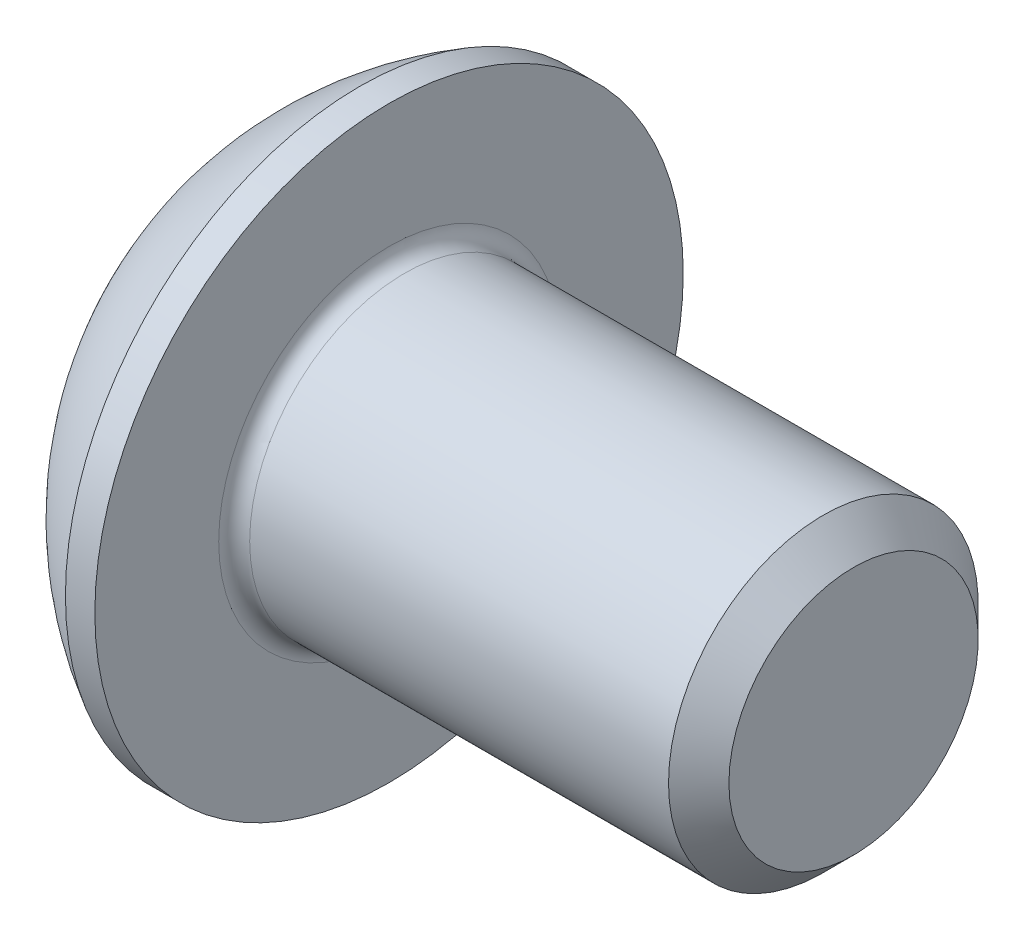
ISO-10303-21;
HEADER;
FILE_DESCRIPTION(('STEP AP214'),'2;1');
FILE_NAME('part.step','',(''),(''),'','','');
FILE_SCHEMA(('AUTOMOTIVE_DESIGN { 1 0 10303 214 1 1 1 1 }'));
ENDSEC;
DATA;
#1=APPLICATION_CONTEXT('core data for automotive mechanical design processes');
#2=APPLICATION_PROTOCOL_DEFINITION('international standard','automotive_design',2000,#1);
#3=PRODUCT_CONTEXT('',#1,'mechanical');
#4=PRODUCT('Part','Part','',(#3));
#5=PRODUCT_RELATED_PRODUCT_CATEGORY('part','',(#4));
#6=PRODUCT_DEFINITION_FORMATION('','',#4);
#7=PRODUCT_DEFINITION_CONTEXT('part definition',#1,'design');
#8=PRODUCT_DEFINITION('design','',#6,#7);
#9=PRODUCT_DEFINITION_SHAPE('','',#8);
#10=(LENGTH_UNIT() NAMED_UNIT(*) SI_UNIT(.MILLI.,.METRE.));
#11=(NAMED_UNIT(*) PLANE_ANGLE_UNIT() SI_UNIT($,.RADIAN.));
#12=(NAMED_UNIT(*) SI_UNIT($,.STERADIAN.) SOLID_ANGLE_UNIT());
#13=UNCERTAINTY_MEASURE_WITH_UNIT(LENGTH_MEASURE(1.E-05),#10,'distance_accuracy_value','');
#14=(GEOMETRIC_REPRESENTATION_CONTEXT(3) GLOBAL_UNCERTAINTY_ASSIGNED_CONTEXT((#13)) GLOBAL_UNIT_ASSIGNED_CONTEXT((#10,
#11,#12)) REPRESENTATION_CONTEXT('',''));
#15=CARTESIAN_POINT('',(0.,0.,0.));
#16=DIRECTION('',(0.,0.,1.));
#17=DIRECTION('',(1.,0.,0.));
#18=AXIS2_PLACEMENT_3D('',#15,#16,#17);
#19=CARTESIAN_POINT('',(0.,0.,0.));
#20=DIRECTION('',(-1.,0.,0.));
#21=DIRECTION('',(0.,0.,1.));
#22=AXIS2_PLACEMENT_3D('',#19,#20,#21);
#23=PLANE('',#22);
#24=CARTESIAN_POINT('',(0.,0.,0.));
#25=DIRECTION('',(-1.,0.,0.));
#26=DIRECTION('',(0.,0.,1.));
#27=AXIS2_PLACEMENT_3D('',#24,#25,#26);
#28=CIRCLE('',#27,1.9);
#29=CARTESIAN_POINT('',(0.,0.,1.9));
#30=VERTEX_POINT('',#29);
#31=EDGE_CURVE('E160',#30,#30,#28,.T.);
#32=ORIENTED_EDGE('',*,*,#31,.T.);
#33=EDGE_LOOP('',(#32));
#34=FACE_BOUND('',#33,.T.);
#35=DIRECTION('',(0.,-1.,0.));
#36=VECTOR('',#35,1.);
#37=CARTESIAN_POINT('',(0.,-0.721687836487045,1.24999999999986));
#38=LINE('',#37,#36);
#39=CARTESIAN_POINT('',(0.,0.721687836487378,1.25000000000008));
#40=VERTEX_POINT('',#39);
#41=CARTESIAN_POINT('',(0.,-0.721687836487045,1.24999999999986));
#42=VERTEX_POINT('',#41);
#43=EDGE_CURVE('E55',#40,#42,#38,.T.);
#44=ORIENTED_EDGE('',*,*,#43,.T.);
#45=DIRECTION('',(0.,-0.500000000000001,-0.86602540378444));
#46=VECTOR('',#45,1.);
#47=CARTESIAN_POINT('',(0.,-1.44337567297406,-1.66533453693773E-13));
#48=LINE('',#47,#46);
#49=CARTESIAN_POINT('',(0.,-1.44337567297406,-1.66533453693773E-13));
#50=VERTEX_POINT('',#49);
#51=EDGE_CURVE('E280',#42,#50,#48,.T.);
#52=ORIENTED_EDGE('',*,*,#51,.T.);
#53=DIRECTION('',(0.,0.5,-0.866025403784439));
#54=VECTOR('',#53,1.);
#55=CARTESIAN_POINT('',(0.,-0.7216878364871,-1.24999999999997));
#56=LINE('',#55,#54);
#57=CARTESIAN_POINT('',(0.,-0.7216878364871,-1.24999999999997));
#58=VERTEX_POINT('',#57);
#59=EDGE_CURVE('E135',#50,#58,#56,.T.);
#60=ORIENTED_EDGE('',*,*,#59,.T.);
#61=DIRECTION('',(0.,1.,0.));
#62=VECTOR('',#61,1.);
#63=CARTESIAN_POINT('',(0.,0.721687836486962,-1.24999999999997));
#64=LINE('',#63,#62);
#65=CARTESIAN_POINT('',(0.,0.721687836486962,-1.24999999999997));
#66=VERTEX_POINT('',#65);
#67=EDGE_CURVE('E283',#58,#66,#64,.T.);
#68=ORIENTED_EDGE('',*,*,#67,.T.);
#69=DIRECTION('',(0.,0.5,0.86602540378444));
#70=VECTOR('',#69,1.);
#71=CARTESIAN_POINT('',(0.,1.44337567297384,0.));
#72=LINE('',#71,#70);
#73=CARTESIAN_POINT('',(0.,1.44337567297384,0.));
#74=VERTEX_POINT('',#73);
#75=EDGE_CURVE('E285',#66,#74,#72,.T.);
#76=ORIENTED_EDGE('',*,*,#75,.T.);
#77=DIRECTION('',(0.,-0.500000000000001,0.86602540378444));
#78=VECTOR('',#77,1.);
#79=CARTESIAN_POINT('',(0.,0.721687836487378,1.25000000000008));
#80=LINE('',#79,#78);
#81=EDGE_CURVE('E287',#74,#40,#80,.T.);
#82=ORIENTED_EDGE('',*,*,#81,.T.);
#83=EDGE_LOOP('',(#44,#52,#60,#68,#76,#82));
#84=FACE_BOUND('',#83,.T.);
#85=ADVANCED_FACE('F40',(#34,#84),#23,.T.);
#86=CARTESIAN_POINT('',(3.88527472527479,-1.38777878078145E-13,-2.22044604925031E-13));
#87=DIRECTION('',(-1.,0.,0.));
#88=DIRECTION('',(0.,1.,0.));
#89=AXIS2_PLACEMENT_3D('',#86,#87,#88);
#90=SPHERICAL_SURFACE('',#89,4.3249693283142);
#91=CARTESIAN_POINT('',(1.82000000000005,0.,0.));
#92=DIRECTION('',(-1.,0.,0.));
#93=DIRECTION('',(0.,0.,1.));
#94=AXIS2_PLACEMENT_3D('',#91,#92,#93);
#95=CIRCLE('',#94,3.8);
#96=CARTESIAN_POINT('',(1.82000000000005,0.,3.80000000000006));
#97=VERTEX_POINT('',#96);
#98=EDGE_CURVE('E157',#97,#97,#95,.T.);
#99=ORIENTED_EDGE('',*,*,#98,.T.);
#100=EDGE_LOOP('',(#99));
#101=FACE_BOUND('',#100,.T.);
#102=ORIENTED_EDGE('',*,*,#31,.F.);
#103=EDGE_LOOP('',(#102));
#104=FACE_BOUND('',#103,.T.);
#105=ADVANCED_FACE('F181',(#101,#104),#90,.T.);
#106=CARTESIAN_POINT('',(0.,0.,0.));
#107=DIRECTION('',(-1.,0.,0.));
#108=DIRECTION('',(0.,0.,1.));
#109=AXIS2_PLACEMENT_3D('',#106,#107,#108);
#110=CYLINDRICAL_SURFACE('',#109,3.8);
#111=ORIENTED_EDGE('',*,*,#98,.F.);
#112=EDGE_LOOP('',(#111));
#113=FACE_BOUND('',#112,.T.);
#114=CARTESIAN_POINT('',(2.19999999999999,-1.38777878078145E-13,0.));
#115=DIRECTION('',(-1.,0.,0.));
#116=DIRECTION('',(0.,0.,1.));
#117=AXIS2_PLACEMENT_3D('',#114,#115,#116);
#118=CIRCLE('',#117,3.8);
#119=CARTESIAN_POINT('',(2.19999999999999,-1.37723166204751E-13,3.80000000000001));
#120=VERTEX_POINT('',#119);
#121=EDGE_CURVE('E154',#120,#120,#118,.T.);
#122=ORIENTED_EDGE('',*,*,#121,.T.);
#123=EDGE_LOOP('',(#122));
#124=FACE_BOUND('',#123,.T.);
#125=ADVANCED_FACE('F186',(#113,#124),#110,.T.);
#126=CARTESIAN_POINT('',(2.19999999999998,2.00000000000025,-2.77555756156289E-13));
#127=DIRECTION('',(-1.,0.,0.));
#128=DIRECTION('',(0.,0.,1.));
#129=AXIS2_PLACEMENT_3D('',#126,#127,#128);
#130=PLANE('',#129);
#131=CARTESIAN_POINT('',(2.19999999999999,-1.38777878078145E-13,0.));
#132=DIRECTION('',(-1.,0.,0.));
#133=DIRECTION('',(0.,0.,1.));
#134=AXIS2_PLACEMENT_3D('',#131,#132,#133);
#135=CIRCLE('',#134,2.2);
#136=CARTESIAN_POINT('',(2.19999999999999,-1.38167255414601E-13,2.2));
#137=VERTEX_POINT('',#136);
#138=EDGE_CURVE('E48',#137,#137,#135,.T.);
#139=ORIENTED_EDGE('',*,*,#138,.T.);
#140=EDGE_LOOP('',(#139));
#141=FACE_BOUND('',#140,.T.);
#142=ORIENTED_EDGE('',*,*,#121,.F.);
#143=EDGE_LOOP('',(#142));
#144=FACE_BOUND('',#143,.T.);
#145=ADVANCED_FACE('F165',(#141,#144),#130,.F.);
#146=CARTESIAN_POINT('',(0.,0.,0.));
#147=DIRECTION('',(-1.,0.,0.));
#148=DIRECTION('',(0.,0.,1.));
#149=AXIS2_PLACEMENT_3D('',#146,#147,#148);
#150=CYLINDRICAL_SURFACE('',#149,2.);
#151=CARTESIAN_POINT('',(2.39999999999996,0.,-1.11022302462516E-13));
#152=DIRECTION('',(-1.,0.,0.));
#153=DIRECTION('',(0.,0.,1.));
#154=AXIS2_PLACEMENT_3D('',#151,#152,#153);
#155=CIRCLE('',#154,2.);
#156=CARTESIAN_POINT('',(2.39999999999996,0.,1.99999999999989));
#157=VERTEX_POINT('',#156);
#158=EDGE_CURVE('E11',#157,#157,#155,.F.);
#159=ORIENTED_EDGE('',*,*,#158,.T.);
#160=EDGE_LOOP('',(#159));
#161=FACE_BOUND('',#160,.T.);
#162=CARTESIAN_POINT('',(7.80999999999999,0.,0.));
#163=DIRECTION('',(-1.,0.,0.));
#164=DIRECTION('',(0.,0.,1.));
#165=AXIS2_PLACEMENT_3D('',#162,#163,#164);
#166=CIRCLE('',#165,2.);
#167=CARTESIAN_POINT('',(7.80999999999999,0.,2.));
#168=VERTEX_POINT('',#167);
#169=EDGE_CURVE('E151',#168,#168,#166,.T.);
#170=ORIENTED_EDGE('',*,*,#169,.T.);
#171=EDGE_LOOP('',(#170));
#172=FACE_BOUND('',#171,.T.);
#173=ADVANCED_FACE('F195',(#161,#172),#150,.T.);
#174=CARTESIAN_POINT('',(8.19999999999999,0.,0.));
#175=DIRECTION('',(-1.,0.,0.));
#176=DIRECTION('',(0.,0.,1.));
#177=AXIS2_PLACEMENT_3D('',#174,#175,#176);
#178=CONICAL_SURFACE('',#177,1.61,0.785398163397449);
#179=ORIENTED_EDGE('',*,*,#169,.F.);
#180=EDGE_LOOP('',(#179));
#181=FACE_BOUND('',#180,.T.);
#182=CARTESIAN_POINT('',(8.19999999999999,0.,0.));
#183=DIRECTION('',(-1.,0.,0.));
#184=DIRECTION('',(0.,0.,1.));
#185=AXIS2_PLACEMENT_3D('',#182,#183,#184);
#186=CIRCLE('',#185,1.61);
#187=CARTESIAN_POINT('',(8.19999999999999,0.,1.60999999999995));
#188=VERTEX_POINT('',#187);
#189=EDGE_CURVE('E147',#188,#188,#186,.T.);
#190=ORIENTED_EDGE('',*,*,#189,.T.);
#191=EDGE_LOOP('',(#190));
#192=FACE_BOUND('',#191,.T.);
#193=ADVANCED_FACE('F176',(#181,#192),#178,.T.);
#194=CARTESIAN_POINT('',(8.19999999999999,0.,0.));
#195=DIRECTION('',(-1.,0.,0.));
#196=DIRECTION('',(0.,0.,1.));
#197=AXIS2_PLACEMENT_3D('',#194,#195,#196);
#198=PLANE('',#197);
#199=ORIENTED_EDGE('',*,*,#189,.F.);
#200=EDGE_LOOP('',(#199));
#201=FACE_BOUND('',#200,.T.);
#202=ADVANCED_FACE('F169',(#201),#198,.F.);
#203=CARTESIAN_POINT('',(2.39999999999996,0.,-1.11022302462516E-13));
#204=DIRECTION('',(-1.,0.,0.));
#205=DIRECTION('',(0.,0.,1.));
#206=AXIS2_PLACEMENT_3D('',#203,#204,#205);
#207=TOROIDAL_SURFACE('',#206,2.2,0.2);
#208=ORIENTED_EDGE('',*,*,#158,.F.);
#209=EDGE_LOOP('',(#208));
#210=FACE_BOUND('',#209,.T.);
#211=ORIENTED_EDGE('',*,*,#138,.F.);
#212=EDGE_LOOP('',(#211));
#213=FACE_BOUND('',#212,.T.);
#214=ADVANCED_FACE('F42',(#210,#213),#207,.F.);
#215=CARTESIAN_POINT('',(1.29999999999997,-1.44337567297428,-1.11022302462516E-13));
#216=DIRECTION('',(0.,0.866025403784439,-0.500000000000001));
#217=DIRECTION('',(0.,0.500000000000001,0.86602540378444));
#218=AXIS2_PLACEMENT_3D('',#215,#216,#217);
#219=PLANE('',#218);
#220=DIRECTION('',(0.,-0.500000000000001,-0.86602540378444));
#221=VECTOR('',#220,1.);
#222=CARTESIAN_POINT('',(1.29999999999997,-1.44337567297428,-1.11022302462516E-13));
#223=LINE('',#222,#221);
#224=CARTESIAN_POINT('',(1.29999999999997,-0.721687836486712,1.25000000000003));
#225=VERTEX_POINT('',#224);
#226=CARTESIAN_POINT('',(1.29999999999998,-1.08253175473091,0.625000000000153));
#227=VERTEX_POINT('',#226);
#228=EDGE_CURVE('E121',#225,#227,#223,.T.);
#229=ORIENTED_EDGE('',*,*,#228,.T.);
#230=CARTESIAN_POINT('',(1.29999999999997,-1.44337567297428,-1.11022302462516E-13));
#231=VERTEX_POINT('',#230);
#232=EDGE_CURVE('E116',#227,#231,#223,.T.);
#233=ORIENTED_EDGE('',*,*,#232,.T.);
#234=DIRECTION('',(-1.,0.,0.));
#235=VECTOR('',#234,1.);
#236=CARTESIAN_POINT('',(1.29999999999997,-1.44337567297428,-1.11022302462516E-13));
#237=LINE('',#236,#235);
#238=EDGE_CURVE('E118',#231,#50,#237,.T.);
#239=ORIENTED_EDGE('',*,*,#238,.T.);
#240=ORIENTED_EDGE('',*,*,#51,.F.);
#241=DIRECTION('',(-1.,0.,0.));
#242=VECTOR('',#241,1.);
#243=CARTESIAN_POINT('',(1.29999999999997,-0.721687836486712,1.25000000000003));
#244=LINE('',#243,#242);
#245=EDGE_CURVE('E276',#225,#42,#244,.T.);
#246=ORIENTED_EDGE('',*,*,#245,.F.);
#247=EDGE_LOOP('',(#229,#233,#239,#240,#246));
#248=FACE_BOUND('',#247,.T.);
#249=ADVANCED_FACE('F117',(#248),#219,.T.);
#250=CARTESIAN_POINT('',(1.29999999999998,-0.721687836486989,-1.24999999999992));
#251=DIRECTION('',(0.,0.866025403784439,0.500000000000001));
#252=DIRECTION('',(0.,-0.500000000000001,0.86602540378444));
#253=AXIS2_PLACEMENT_3D('',#250,#251,#252);
#254=PLANE('',#253);
#255=DIRECTION('',(0.,0.5,-0.866025403784439));
#256=VECTOR('',#255,1.);
#257=CARTESIAN_POINT('',(1.29999999999998,-0.721687836486989,-1.24999999999992));
#258=LINE('',#257,#256);
#259=CARTESIAN_POINT('',(1.29999999999998,-1.08253175473039,-0.624999999999987));
#260=VERTEX_POINT('',#259);
#261=EDGE_CURVE('E63',#231,#260,#258,.T.);
#262=ORIENTED_EDGE('',*,*,#261,.T.);
#263=CARTESIAN_POINT('',(1.29999999999998,-0.721687836486989,-1.24999999999992));
#264=VERTEX_POINT('',#263);
#265=EDGE_CURVE('E130',#260,#264,#258,.T.);
#266=ORIENTED_EDGE('',*,*,#265,.T.);
#267=DIRECTION('',(-1.,0.,0.));
#268=VECTOR('',#267,1.);
#269=CARTESIAN_POINT('',(1.29999999999998,-0.721687836486989,-1.24999999999992));
#270=LINE('',#269,#268);
#271=EDGE_CURVE('E137',#264,#58,#270,.T.);
#272=ORIENTED_EDGE('',*,*,#271,.T.);
#273=ORIENTED_EDGE('',*,*,#59,.F.);
#274=ORIENTED_EDGE('',*,*,#238,.F.);
#275=EDGE_LOOP('',(#262,#266,#272,#273,#274));
#276=FACE_BOUND('',#275,.T.);
#277=ADVANCED_FACE('F133',(#276),#254,.T.);
#278=CARTESIAN_POINT('',(1.29999999999998,0.721687836486934,-1.25000000000008));
#279=DIRECTION('',(0.,0.,1.));
#280=DIRECTION('',(1.,0.,0.));
#281=AXIS2_PLACEMENT_3D('',#278,#279,#280);
#282=PLANE('',#281);
#283=DIRECTION('',(0.,1.,0.));
#284=VECTOR('',#283,1.);
#285=CARTESIAN_POINT('',(1.29999999999998,0.721687836486934,-1.25000000000008));
#286=LINE('',#285,#284);
#287=CARTESIAN_POINT('',(1.29999999999999,1.38777878078145E-13,-1.25000000000008));
#288=VERTEX_POINT('',#287);
#289=EDGE_CURVE('E257',#264,#288,#286,.T.);
#290=ORIENTED_EDGE('',*,*,#289,.T.);
#291=CARTESIAN_POINT('',(1.29999999999998,0.721687836486934,-1.25000000000008));
#292=VERTEX_POINT('',#291);
#293=EDGE_CURVE('E129',#288,#292,#286,.T.);
#294=ORIENTED_EDGE('',*,*,#293,.T.);
#295=DIRECTION('',(-1.,0.,0.));
#296=VECTOR('',#295,1.);
#297=CARTESIAN_POINT('',(1.29999999999998,0.721687836486934,-1.25000000000008));
#298=LINE('',#297,#296);
#299=EDGE_CURVE('E142',#292,#66,#298,.T.);
#300=ORIENTED_EDGE('',*,*,#299,.T.);
#301=ORIENTED_EDGE('',*,*,#67,.F.);
#302=ORIENTED_EDGE('',*,*,#271,.F.);
#303=EDGE_LOOP('',(#290,#294,#300,#301,#302));
#304=FACE_BOUND('',#303,.T.);
#305=ADVANCED_FACE('F209',(#304),#282,.T.);
#306=CARTESIAN_POINT('',(1.29999999999998,1.44337567297395,0.));
#307=DIRECTION('',(0.,-0.866025403784439,0.500000000000001));
#308=DIRECTION('',(0.,-0.5,-0.86602540378444));
#309=AXIS2_PLACEMENT_3D('',#306,#307,#308);
#310=PLANE('',#309);
#311=DIRECTION('',(0.,0.5,0.86602540378444));
#312=VECTOR('',#311,1.);
#313=CARTESIAN_POINT('',(1.29999999999998,1.44337567297395,0.));
#314=LINE('',#313,#312);
#315=CARTESIAN_POINT('',(1.29999999999997,1.08253175473047,-0.625000000000153));
#316=VERTEX_POINT('',#315);
#317=EDGE_CURVE('E246',#292,#316,#314,.T.);
#318=ORIENTED_EDGE('',*,*,#317,.T.);
#319=CARTESIAN_POINT('',(1.29999999999998,1.44337567297395,0.));
#320=VERTEX_POINT('',#319);
#321=EDGE_CURVE('E251',#316,#320,#314,.T.);
#322=ORIENTED_EDGE('',*,*,#321,.T.);
#323=DIRECTION('',(-1.,0.,0.));
#324=VECTOR('',#323,1.);
#325=CARTESIAN_POINT('',(1.29999999999998,1.44337567297395,0.));
#326=LINE('',#325,#324);
#327=EDGE_CURVE('E291',#320,#74,#326,.T.);
#328=ORIENTED_EDGE('',*,*,#327,.T.);
#329=ORIENTED_EDGE('',*,*,#75,.F.);
#330=ORIENTED_EDGE('',*,*,#299,.F.);
#331=EDGE_LOOP('',(#318,#322,#328,#329,#330));
#332=FACE_BOUND('',#331,.T.);
#333=ADVANCED_FACE('F212',(#332),#310,.T.);
#334=CARTESIAN_POINT('',(1.29999999999997,0.721687836487267,1.25000000000014));
#335=DIRECTION('',(0.,-0.866025403784439,-0.500000000000001));
#336=DIRECTION('',(0.,0.500000000000001,-0.86602540378444));
#337=AXIS2_PLACEMENT_3D('',#334,#335,#336);
#338=PLANE('',#337);
#339=DIRECTION('',(0.,-0.500000000000001,0.86602540378444));
#340=VECTOR('',#339,1.);
#341=CARTESIAN_POINT('',(1.29999999999997,0.721687836487267,1.25000000000014));
#342=LINE('',#341,#340);
#343=CARTESIAN_POINT('',(1.29999999999999,1.08253175473091,0.625000000000042));
#344=VERTEX_POINT('',#343);
#345=EDGE_CURVE('E254',#320,#344,#342,.T.);
#346=ORIENTED_EDGE('',*,*,#345,.T.);
#347=CARTESIAN_POINT('',(1.29999999999997,0.721687836487267,1.25000000000014));
#348=VERTEX_POINT('',#347);
#349=EDGE_CURVE('E262',#344,#348,#342,.T.);
#350=ORIENTED_EDGE('',*,*,#349,.T.);
#351=DIRECTION('',(-1.,0.,0.));
#352=VECTOR('',#351,1.);
#353=CARTESIAN_POINT('',(1.29999999999997,0.721687836487267,1.25000000000014));
#354=LINE('',#353,#352);
#355=EDGE_CURVE('E275',#348,#40,#354,.T.);
#356=ORIENTED_EDGE('',*,*,#355,.T.);
#357=ORIENTED_EDGE('',*,*,#81,.F.);
#358=ORIENTED_EDGE('',*,*,#327,.F.);
#359=EDGE_LOOP('',(#346,#350,#356,#357,#358));
#360=FACE_BOUND('',#359,.T.);
#361=ADVANCED_FACE('F216',(#360),#338,.T.);
#362=CARTESIAN_POINT('',(1.29999999999997,-0.721687836486712,1.25000000000003));
#363=DIRECTION('',(0.,0.,-1.));
#364=DIRECTION('',(0.,1.,0.));
#365=AXIS2_PLACEMENT_3D('',#362,#363,#364);
#366=PLANE('',#365);
#367=DIRECTION('',(0.,-1.,0.));
#368=VECTOR('',#367,1.);
#369=CARTESIAN_POINT('',(1.29999999999997,-0.721687836486712,1.25000000000003));
#370=LINE('',#369,#368);
#371=CARTESIAN_POINT('',(1.29999999999997,1.11022302462516E-13,1.25000000000003));
#372=VERTEX_POINT('',#371);
#373=EDGE_CURVE('E268',#348,#372,#370,.T.);
#374=ORIENTED_EDGE('',*,*,#373,.T.);
#375=EDGE_CURVE('E270',#372,#225,#370,.T.);
#376=ORIENTED_EDGE('',*,*,#375,.T.);
#377=ORIENTED_EDGE('',*,*,#245,.T.);
#378=ORIENTED_EDGE('',*,*,#43,.F.);
#379=ORIENTED_EDGE('',*,*,#355,.F.);
#380=EDGE_LOOP('',(#374,#376,#377,#378,#379));
#381=FACE_BOUND('',#380,.T.);
#382=ADVANCED_FACE('F220',(#381),#366,.T.);
#383=CARTESIAN_POINT('',(1.29999999999997,-1.44337567297428,-1.11022302462516E-13));
#384=DIRECTION('',(1.,0.,0.));
#385=DIRECTION('',(0.,0.,-1.));
#386=AXIS2_PLACEMENT_3D('',#383,#384,#385);
#387=PLANE('',#386);
#388=CARTESIAN_POINT('',(1.29999999999997,0.,0.));
#389=DIRECTION('',(-1.,0.,0.));
#390=DIRECTION('',(0.,0.,1.));
#391=AXIS2_PLACEMENT_3D('',#388,#389,#390);
#392=CIRCLE('',#391,1.25);
#393=EDGE_CURVE('E243',#316,#288,#392,.T.);
#394=ORIENTED_EDGE('',*,*,#393,.F.);
#395=ORIENTED_EDGE('',*,*,#317,.F.);
#396=ORIENTED_EDGE('',*,*,#293,.F.);
#397=EDGE_LOOP('',(#394,#395,#396));
#398=FACE_BOUND('',#397,.T.);
#399=ADVANCED_FACE('F224',(#398),#387,.F.);
#400=EDGE_CURVE('E148',#344,#316,#392,.T.);
#401=ORIENTED_EDGE('',*,*,#400,.F.);
#402=ORIENTED_EDGE('',*,*,#345,.F.);
#403=ORIENTED_EDGE('',*,*,#321,.F.);
#404=EDGE_LOOP('',(#401,#402,#403));
#405=FACE_BOUND('',#404,.T.);
#406=ADVANCED_FACE('F233',(#405),#387,.F.);
#407=EDGE_CURVE('E141',#372,#344,#392,.T.);
#408=ORIENTED_EDGE('',*,*,#407,.F.);
#409=ORIENTED_EDGE('',*,*,#373,.F.);
#410=ORIENTED_EDGE('',*,*,#349,.F.);
#411=EDGE_LOOP('',(#408,#409,#410));
#412=FACE_BOUND('',#411,.T.);
#413=ADVANCED_FACE('F238',(#412),#387,.F.);
#414=EDGE_CURVE('E136',#227,#372,#392,.T.);
#415=ORIENTED_EDGE('',*,*,#414,.F.);
#416=ORIENTED_EDGE('',*,*,#228,.F.);
#417=ORIENTED_EDGE('',*,*,#375,.F.);
#418=EDGE_LOOP('',(#415,#416,#417));
#419=FACE_BOUND('',#418,.T.);
#420=ADVANCED_FACE('F231',(#419),#387,.F.);
#421=EDGE_CURVE('E127',#260,#227,#392,.T.);
#422=ORIENTED_EDGE('',*,*,#421,.F.);
#423=ORIENTED_EDGE('',*,*,#261,.F.);
#424=ORIENTED_EDGE('',*,*,#232,.F.);
#425=EDGE_LOOP('',(#422,#423,#424));
#426=FACE_BOUND('',#425,.T.);
#427=ADVANCED_FACE('F126',(#426),#387,.F.);
#428=EDGE_CURVE('E249',#288,#260,#392,.T.);
#429=ORIENTED_EDGE('',*,*,#428,.F.);
#430=ORIENTED_EDGE('',*,*,#289,.F.);
#431=ORIENTED_EDGE('',*,*,#265,.F.);
#432=EDGE_LOOP('',(#429,#430,#431));
#433=FACE_BOUND('',#432,.T.);
#434=ADVANCED_FACE('F204',(#433),#387,.F.);
#435=CARTESIAN_POINT('',(2.02168783648705,0.,0.));
#436=DIRECTION('',(-1.,0.,0.));
#437=DIRECTION('',(0.,0.,1.));
#438=AXIS2_PLACEMENT_3D('',#435,#436,#437);
#439=CONICAL_SURFACE('',#438,0.,1.04719755119659);
#440=ORIENTED_EDGE('',*,*,#407,.T.);
#441=ORIENTED_EDGE('',*,*,#400,.T.);
#442=ORIENTED_EDGE('',*,*,#393,.T.);
#443=ORIENTED_EDGE('',*,*,#428,.T.);
#444=ORIENTED_EDGE('',*,*,#421,.T.);
#445=ORIENTED_EDGE('',*,*,#414,.T.);
#446=EDGE_LOOP('',(#440,#441,#442,#443,#444,#445));
#447=FACE_BOUND('',#446,.T.);
#448=CARTESIAN_POINT('',(2.02168783648705,0.,0.));
#449=VERTEX_POINT('',#448);
#450=VERTEX_LOOP('',#449);
#451=FACE_BOUND('',#450,.T.);
#452=ADVANCED_FACE('F202',(#447,#451),#439,.F.);
#453=CLOSED_SHELL('',(#85,#105,#125,#145,#173,#193,#202,#214,#249,#277,#305,#333,#361,#382,#399,
#406,#413,#420,#427,#434,#452));
#454=MANIFOLD_SOLID_BREP('B2',#453);
#455=ADVANCED_BREP_SHAPE_REPRESENTATION('',(#18,#454),#14);
#456=SHAPE_DEFINITION_REPRESENTATION(#9,#455);
ENDSEC;
END-ISO-10303-21;
